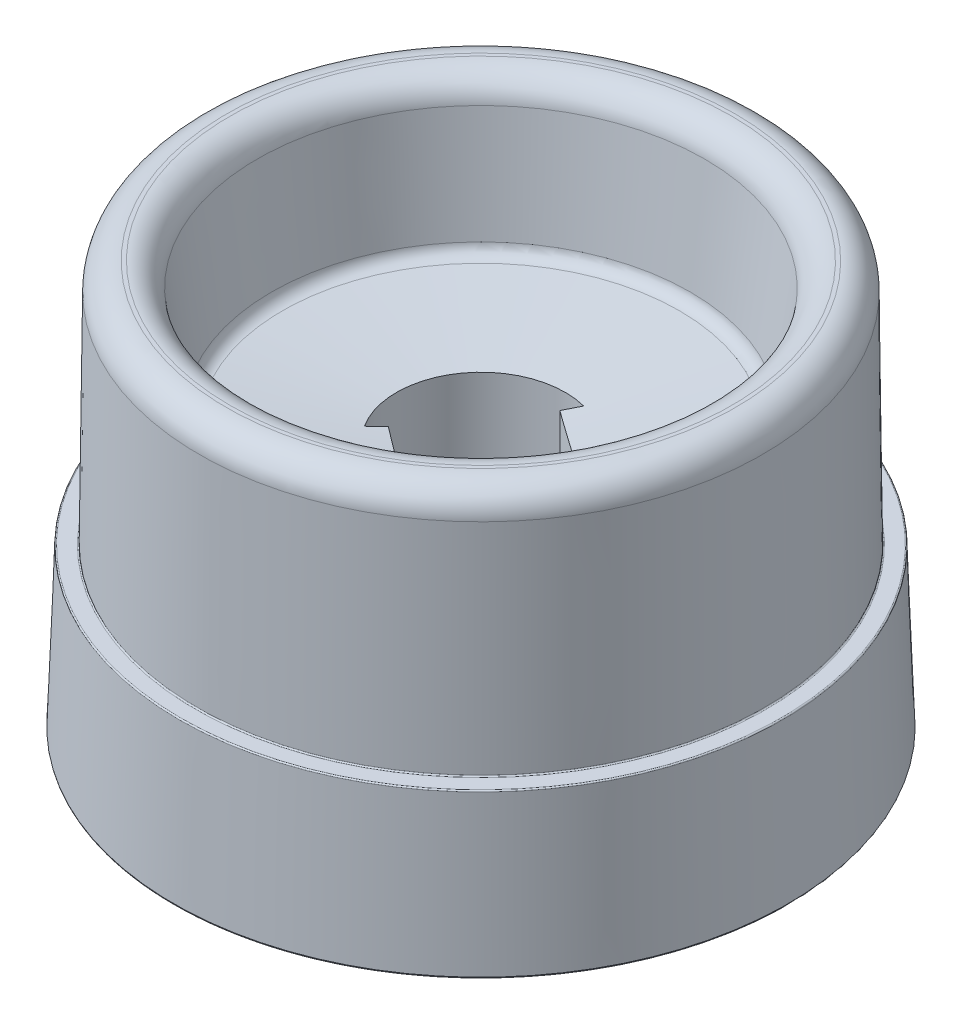
ISO-10303-21;
HEADER;
FILE_DESCRIPTION(('STEP AP214'),'2;1');
FILE_NAME('part.step','',(''),(''),'','','');
FILE_SCHEMA(('AUTOMOTIVE_DESIGN { 1 0 10303 214 1 1 1 1 }'));
ENDSEC;
DATA;
#1=APPLICATION_CONTEXT('core data for automotive mechanical design processes');
#2=APPLICATION_PROTOCOL_DEFINITION('international standard','automotive_design',2000,#1);
#3=PRODUCT_CONTEXT('',#1,'mechanical');
#4=PRODUCT('Part','Part','',(#3));
#5=PRODUCT_RELATED_PRODUCT_CATEGORY('part','',(#4));
#6=PRODUCT_DEFINITION_FORMATION('','',#4);
#7=PRODUCT_DEFINITION_CONTEXT('part definition',#1,'design');
#8=PRODUCT_DEFINITION('design','',#6,#7);
#9=PRODUCT_DEFINITION_SHAPE('','',#8);
#10=(LENGTH_UNIT() NAMED_UNIT(*) SI_UNIT(.MILLI.,.METRE.));
#11=(NAMED_UNIT(*) PLANE_ANGLE_UNIT() SI_UNIT($,.RADIAN.));
#12=(NAMED_UNIT(*) SI_UNIT($,.STERADIAN.) SOLID_ANGLE_UNIT());
#13=UNCERTAINTY_MEASURE_WITH_UNIT(LENGTH_MEASURE(1.E-05),#10,'distance_accuracy_value','');
#14=(GEOMETRIC_REPRESENTATION_CONTEXT(3) GLOBAL_UNCERTAINTY_ASSIGNED_CONTEXT((#13)) GLOBAL_UNIT_ASSIGNED_CONTEXT((#10,
#11,#12)) REPRESENTATION_CONTEXT('',''));
#15=CARTESIAN_POINT('',(0.,0.,0.));
#16=DIRECTION('',(0.,0.,1.));
#17=DIRECTION('',(1.,0.,0.));
#18=AXIS2_PLACEMENT_3D('',#15,#16,#17);
#19=CARTESIAN_POINT('',(0.,3.7,0.));
#20=DIRECTION('',(0.,-1.,0.));
#21=DIRECTION('',(0.,0.,-1.));
#22=AXIS2_PLACEMENT_3D('',#19,#20,#21);
#23=TOROIDAL_SURFACE('',#22,9.1594331148015,0.5);
#24=CARTESIAN_POINT('',(0.,3.70952208231858,0.));
#25=DIRECTION('',(0.,-1.,0.));
#26=DIRECTION('',(0.,0.,-1.));
#27=AXIS2_PLACEMENT_3D('',#24,#25,#26);
#28=CIRCLE('',#27,9.65934243652726);
#29=CARTESIAN_POINT('',(0.,3.70952208231858,-9.65934243652726));
#30=VERTEX_POINT('',#29);
#31=EDGE_CURVE('E139',#30,#30,#28,.T.);
#32=ORIENTED_EDGE('',*,*,#31,.T.);
#33=EDGE_LOOP('',(#32));
#34=FACE_BOUND('',#33,.T.);
#35=CARTESIAN_POINT('',(0.,4.2,0.));
#36=DIRECTION('',(0.,-1.,0.));
#37=DIRECTION('',(0.,0.,-1.));
#38=AXIS2_PLACEMENT_3D('',#35,#36,#37);
#39=CIRCLE('',#38,9.15943311480149);
#40=CARTESIAN_POINT('',(0.,4.2,-9.15943311480149));
#41=VERTEX_POINT('',#40);
#42=EDGE_CURVE('E194',#41,#41,#39,.T.);
#43=ORIENTED_EDGE('',*,*,#42,.F.);
#44=EDGE_LOOP('',(#43));
#45=FACE_BOUND('',#44,.T.);
#46=ADVANCED_FACE('F32',(#34,#45),#23,.F.);
#47=CARTESIAN_POINT('',(0.,4.2,0.));
#48=DIRECTION('',(0.,-1.,0.));
#49=DIRECTION('',(0.,0.,-1.));
#50=AXIS2_PLACEMENT_3D('',#47,#48,#49);
#51=PLANE('',#50);
#52=DIRECTION('',(-0.802543407330074,0.,-0.596593730566317));
#53=VECTOR('',#52,1.);
#54=CARTESIAN_POINT('',(-2.43770225381179,4.2,1.26780057194422));
#55=LINE('',#54,#53);
#56=CARTESIAN_POINT('',(-0.511598076219613,4.2,2.69962552530338));
#57=VERTEX_POINT('',#56);
#58=CARTESIAN_POINT('',(-2.43770225381179,4.2,1.26780057194422));
#59=VERTEX_POINT('',#58);
#60=EDGE_CURVE('E51',#57,#59,#55,.T.);
#61=ORIENTED_EDGE('',*,*,#60,.F.);
#62=DIRECTION('',(0.596593730566317,0.,-0.802543407330074));
#63=VECTOR('',#62,1.);
#64=CARTESIAN_POINT('',(-0.511598076219613,4.2,2.69962552530338));
#65=LINE('',#64,#63);
#66=CARTESIAN_POINT('',(-0.918959562800941,4.2,3.24761196683988));
#67=VERTEX_POINT('',#66);
#68=EDGE_CURVE('E134',#67,#57,#65,.T.);
#69=ORIENTED_EDGE('',*,*,#68,.F.);
#70=CARTESIAN_POINT('',(0.,4.2,0.));
#71=DIRECTION('',(0.,-1.,0.));
#72=DIRECTION('',(0.,0.,-1.));
#73=AXIS2_PLACEMENT_3D('',#70,#71,#72);
#74=CIRCLE('',#73,3.37512520734045);
#75=CARTESIAN_POINT('',(2.79957627615245,4.2,-1.88516387596127));
#76=VERTEX_POINT('',#75);
#77=EDGE_CURVE('E131',#76,#67,#74,.T.);
#78=ORIENTED_EDGE('',*,*,#77,.F.);
#79=DIRECTION('',(0.576688769844115,0.,-0.816963929886554));
#80=VECTOR('',#79,1.);
#81=CARTESIAN_POINT('',(2.40580613988994,4.2,-1.32733092547753));
#82=LINE('',#81,#80);
#83=CARTESIAN_POINT('',(2.40580613988994,4.2,-1.32733092547753));
#84=VERTEX_POINT('',#83);
#85=EDGE_CURVE('E128',#84,#76,#82,.T.);
#86=ORIENTED_EDGE('',*,*,#85,.F.);
#87=DIRECTION('',(0.816963929886553,0.,0.576688769844115));
#88=VECTOR('',#87,1.);
#89=CARTESIAN_POINT('',(0.445092708162211,4.2,-2.7113839731034));
#90=LINE('',#89,#88);
#91=CARTESIAN_POINT('',(0.445092708162211,4.2,-2.7113839731034));
#92=VERTEX_POINT('',#91);
#93=EDGE_CURVE('E122',#92,#84,#90,.T.);
#94=ORIENTED_EDGE('',*,*,#93,.F.);
#95=DIRECTION('',(-0.576688769844114,0.,0.816963929886554));
#96=VECTOR('',#95,1.);
#97=CARTESIAN_POINT('',(0.445092708162211,4.2,-2.7113839731034));
#98=LINE('',#97,#96);
#99=CARTESIAN_POINT('',(0.83886284442472,4.2,-3.26921692358714));
#100=VERTEX_POINT('',#99);
#101=EDGE_CURVE('E120',#100,#92,#98,.T.);
#102=ORIENTED_EDGE('',*,*,#101,.F.);
#103=CARTESIAN_POINT('',(0.,4.2,0.));
#104=DIRECTION('',(0.,-1.,0.));
#105=DIRECTION('',(0.,0.,-1.));
#106=AXIS2_PLACEMENT_3D('',#103,#104,#105);
#107=CIRCLE('',#106,3.37512520734045);
#108=CARTESIAN_POINT('',(-2.84506374039312,4.2,1.81578701348072));
#109=VERTEX_POINT('',#108);
#110=EDGE_CURVE('E103',#109,#100,#107,.T.);
#111=ORIENTED_EDGE('',*,*,#110,.F.);
#112=DIRECTION('',(-0.596593730566317,0.,0.802543407330073));
#113=VECTOR('',#112,1.);
#114=CARTESIAN_POINT('',(-2.43770225381179,4.2,1.26780057194422));
#115=LINE('',#114,#113);
#116=EDGE_CURVE('E112',#59,#109,#115,.T.);
#117=ORIENTED_EDGE('',*,*,#116,.F.);
#118=EDGE_LOOP('',(#61,#69,#78,#86,#94,#102,#111,#117));
#119=FACE_BOUND('',#118,.T.);
#120=ORIENTED_EDGE('',*,*,#42,.T.);
#121=EDGE_LOOP('',(#120));
#122=FACE_BOUND('',#121,.T.);
#123=ADVANCED_FACE('F116',(#119,#122),#51,.T.);
#124=CARTESIAN_POINT('',(0.,10.4837274017397,0.));
#125=DIRECTION('',(0.,1.,0.));
#126=DIRECTION('',(0.,0.,1.));
#127=AXIS2_PLACEMENT_3D('',#124,#125,#126);
#128=CONICAL_SURFACE('',#127,7.93580236429931,1.45118962765516);
#129=CARTESIAN_POINT('',(-2.43790225381179,9.86022942793745,1.26765189619033));
#130=CARTESIAN_POINT('',(-2.35767319360091,9.85498098863404,1.32729247624353));
#131=CARTESIAN_POINT('',(-2.27742145183765,9.8502634166295,1.38694991728123));
#132=CARTESIAN_POINT('',(-2.11687496087276,9.84203499021859,1.50629677017324));
#133=CARTESIAN_POINT('',(-2.03658020999301,9.83852418694828,1.56598618327503));
#134=CARTESIAN_POINT('',(-1.79577414095284,9.8300245839622,1.74499630255273));
#135=CARTESIAN_POINT('',(-1.63521215298427,9.82705969836108,1.86435467558826));
#136=CARTESIAN_POINT('',(-1.31408817704713,9.82705969836108,2.10307142165934));
#137=CARTESIAN_POINT('',(-1.15352618907856,9.8300245839622,2.22242979469487));
#138=CARTESIAN_POINT('',(-0.912720120038388,9.83852418694828,2.40143991397257));
#139=CARTESIAN_POINT('',(-0.832425369158636,9.84203499021859,2.46112932707436));
#140=CARTESIAN_POINT('',(-0.671878878193749,9.8502634166295,2.58047617996637));
#141=CARTESIAN_POINT('',(-0.591627136430488,9.85498098863404,2.64013362100407));
#142=CARTESIAN_POINT('',(-0.511398076219613,9.86022942793745,2.69977420105727));
#143=B_SPLINE_CURVE_WITH_KNOTS('',3,(#129,#130,#131,#132,#133,#134,#135,#136,#137,#138,#139,
#140,#141,#142),.UNSPECIFIED.,.F.,.F.,(4,2,2,2,2,2,4),(0.,0.300316948194724,0.600646620564161,
1.20082370492492,1.80100078928568,2.10133046165512,2.40164740984984),.UNSPECIFIED.);
#144=CARTESIAN_POINT('',(-2.43770225381179,9.86021634674101,1.26780057194422));
#145=VERTEX_POINT('',#144);
#146=CARTESIAN_POINT('',(-0.511598076219613,9.86021634674101,2.69962552530338));
#147=VERTEX_POINT('',#146);
#148=EDGE_CURVE('E11',#145,#147,#143,.T.);
#149=ORIENTED_EDGE('',*,*,#148,.F.);
#150=CARTESIAN_POINT('',(-2.84521241614701,9.93565167759545,1.81598701348072));
#151=CARTESIAN_POINT('',(-2.77728476004543,9.92283973891077,1.72461010187967));
#152=CARTESIAN_POINT('',(-2.70934936586354,9.91014524747306,1.63322278094135));
#153=CARTESIAN_POINT('',(-2.57346308650388,9.88499115634538,1.45042730043373));
#154=CARTESIAN_POINT('',(-2.50551220132274,9.8725315567067,1.35901914085988));
#155=CARTESIAN_POINT('',(-2.4375535780579,9.86018940436627,1.26760057194422));
#156=B_SPLINE_CURVE_WITH_KNOTS('',3,(#150,#151,#152,#153,#154,#155),.UNSPECIFIED.,.F.,.F.,(4,2,
4),(0.,0.343732589252377,0.687465253557977),.UNSPECIFIED.);
#157=CARTESIAN_POINT('',(-2.84506374039312,9.9356236845091,1.81578701348072));
#158=VERTEX_POINT('',#157);
#159=EDGE_CURVE('E197',#158,#145,#156,.T.);
#160=ORIENTED_EDGE('',*,*,#159,.F.);
#161=CARTESIAN_POINT('',(0.,9.9356236845091,0.));
#162=DIRECTION('',(0.,1.,0.));
#163=DIRECTION('',(0.,0.,1.));
#164=AXIS2_PLACEMENT_3D('',#161,#162,#163);
#165=CIRCLE('',#164,3.37512520734045);
#166=CARTESIAN_POINT('',(0.83886284442472,9.9356236845091,-3.26921692358714));
#167=VERTEX_POINT('',#166);
#168=EDGE_CURVE('E106',#167,#158,#165,.T.);
#169=ORIENTED_EDGE('',*,*,#168,.F.);
#170=CARTESIAN_POINT('',(0.444951529647776,9.86018987993127,-2.7111839731034));
#171=CARTESIAN_POINT('',(0.51064191179088,9.87253187676768,-2.80424400055267));
#172=CARTESIAN_POINT('',(0.576324814220776,9.88499131784736,-2.89729343189497));
#173=CARTESIAN_POINT('',(0.707675645314636,9.91014508574724,-3.08337108205159));
#174=CARTESIAN_POINT('',(0.773343573981867,9.92283941251615,-3.17639930087054));
#175=CARTESIAN_POINT('',(0.839004022939154,9.93565118347705,-3.26941692358714));
#176=B_SPLINE_CURVE_WITH_KNOTS('',3,(#170,#171,#172,#173,#174,#175),.UNSPECIFIED.,.F.,.F.,(4,2,
4),(0.,0.343728238803303,0.687456402557285),.UNSPECIFIED.);
#177=CARTESIAN_POINT('',(0.445092708162211,9.86021634674101,-2.7113839731034));
#178=VERTEX_POINT('',#177);
#179=EDGE_CURVE('E366',#178,#167,#176,.T.);
#180=ORIENTED_EDGE('',*,*,#179,.F.);
#181=CARTESIAN_POINT('',(2.40600613988994,9.86022919701751,-1.32718974696309));
#182=CARTESIAN_POINT('',(2.32433578076937,9.85498079246548,-1.38484024683339));
#183=CARTESIAN_POINT('',(2.2426423327344,9.8502632525071,-1.44250704499687));
#184=CARTESIAN_POINT('',(2.07921165687672,9.84203488290862,-1.55787154515081));
#185=CARTESIAN_POINT('',(1.99747442734576,9.83852410440362,-1.61556924834711));
#186=CARTESIAN_POINT('',(1.75234232637222,9.83002456191228,-1.78860617762668));
#187=CARTESIAN_POINT('',(1.58889587519915,9.82705969836108,-1.90398181345857));
#188=CARTESIAN_POINT('',(1.26200297285301,9.82705969836108,-2.13473308512236));
#189=CARTESIAN_POINT('',(1.09855652167993,9.83002456191228,-2.25010872095425));
#190=CARTESIAN_POINT('',(0.853424420706387,9.83852410440362,-2.42314565023382));
#191=CARTESIAN_POINT('',(0.771687191175431,9.84203488290862,-2.48084335343012));
#192=CARTESIAN_POINT('',(0.608256515317747,9.8502632525071,-2.59620785358406));
#193=CARTESIAN_POINT('',(0.526563067282777,9.85498079246548,-2.65387465174754));
#194=CARTESIAN_POINT('',(0.444892708162212,9.86022919701751,-2.71152515161784));
#195=B_SPLINE_CURVE_WITH_KNOTS('',3,(#181,#182,#183,#184,#185,#186,#187,#188,#189,#190,#191,
#192,#193,#194),.UNSPECIFIED.,.F.,.F.,(4,2,2,2,2,2,4),(0.,0.300315845935304,0.600644415830475,
1.20081930025914,1.80099418468781,2.10132275458298,2.40163860051829),.UNSPECIFIED.);
#196=CARTESIAN_POINT('',(2.40580613988994,9.86021634674101,-1.32733092547753));
#197=VERTEX_POINT('',#196);
#198=EDGE_CURVE('E371',#197,#178,#195,.T.);
#199=ORIENTED_EDGE('',*,*,#198,.F.);
#200=CARTESIAN_POINT('',(2.79971745466688,9.93565118347705,-1.88536387596127));
#201=CARTESIAN_POINT('',(2.73405700570959,9.92283941251615,-1.79234625324467));
#202=CARTESIAN_POINT('',(2.66838907704236,9.91014508574724,-1.69931803442571));
#203=CARTESIAN_POINT('',(2.5370382459485,9.88499131784736,-1.51324038426909));
#204=CARTESIAN_POINT('',(2.47135534351861,9.87253187676768,-1.4201909529268));
#205=CARTESIAN_POINT('',(2.4056649613755,9.86018987993127,-1.32713092547753));
#206=B_SPLINE_CURVE_WITH_KNOTS('',3,(#200,#201,#202,#203,#204,#205),.UNSPECIFIED.,.F.,.F.,(4,2,
4),(0.,0.343728163753981,0.687456402557284),.UNSPECIFIED.);
#207=CARTESIAN_POINT('',(2.79957627615245,9.9356236845091,-1.88516387596127));
#208=VERTEX_POINT('',#207);
#209=EDGE_CURVE('E376',#208,#197,#206,.T.);
#210=ORIENTED_EDGE('',*,*,#209,.F.);
#211=CARTESIAN_POINT('',(0.,9.9356236845091,0.));
#212=DIRECTION('',(0.,1.,0.));
#213=DIRECTION('',(0.,0.,1.));
#214=AXIS2_PLACEMENT_3D('',#211,#212,#213);
#215=CIRCLE('',#214,3.37512520734045);
#216=CARTESIAN_POINT('',(-0.918959562800941,9.9356236845091,3.24761196683988));
#217=VERTEX_POINT('',#216);
#218=EDGE_CURVE('E381',#217,#208,#215,.T.);
#219=ORIENTED_EDGE('',*,*,#218,.F.);
#220=CARTESIAN_POINT('',(-0.511449400465724,9.86018940436627,2.69942552530338));
#221=CARTESIAN_POINT('',(-0.579408023730565,9.8725315567067,2.79084409421904));
#222=CARTESIAN_POINT('',(-0.647358908911706,9.88499115634538,2.88225225379289));
#223=CARTESIAN_POINT('',(-0.783245188271362,9.91014524747306,3.06504773430052));
#224=CARTESIAN_POINT('',(-0.851180582453257,9.92283973891077,3.15643505523883));
#225=CARTESIAN_POINT('',(-0.919108238554831,9.93565167759545,3.24781196683988));
#226=B_SPLINE_CURVE_WITH_KNOTS('',3,(#220,#221,#222,#223,#224,#225),.UNSPECIFIED.,.F.,.F.,(4,2,
4),(0.,0.343732664305601,0.687465253557977),.UNSPECIFIED.);
#227=EDGE_CURVE('E44',#147,#217,#226,.T.);
#228=ORIENTED_EDGE('',*,*,#227,.F.);
#229=EDGE_LOOP('',(#149,#160,#169,#180,#199,#210,#219,#228));
#230=FACE_BOUND('',#229,.T.);
#231=CARTESIAN_POINT('',(0.,10.4837274017397,0.));
#232=DIRECTION('',(0.,-1.,0.));
#233=DIRECTION('',(0.,0.,-1.));
#234=AXIS2_PLACEMENT_3D('',#231,#232,#233);
#235=CIRCLE('',#234,7.93580236429931);
#236=CARTESIAN_POINT('',(0.,10.4837274017397,-7.93580236429931));
#237=VERTEX_POINT('',#236);
#238=EDGE_CURVE('E191',#237,#237,#235,.T.);
#239=ORIENTED_EDGE('',*,*,#238,.F.);
#240=EDGE_LOOP('',(#239));
#241=FACE_BOUND('',#240,.T.);
#242=ADVANCED_FACE('F204',(#230,#241),#128,.F.);
#243=CARTESIAN_POINT('',(0.,10.9801552227298,0.));
#244=DIRECTION('',(0.,-1.,0.));
#245=DIRECTION('',(0.,0.,-1.));
#246=AXIS2_PLACEMENT_3D('',#243,#244,#245);
#247=TOROIDAL_SURFACE('',#246,7.87614150152454,0.5);
#248=ORIENTED_EDGE('',*,*,#238,.T.);
#249=EDGE_LOOP('',(#248));
#250=FACE_BOUND('',#249,.T.);
#251=CARTESIAN_POINT('',(0.,10.9144321304999,0.));
#252=DIRECTION('',(0.,-1.,0.));
#253=DIRECTION('',(0.,0.,-1.));
#254=AXIS2_PLACEMENT_3D('',#251,#252,#253);
#255=CIRCLE('',#254,8.3718031554254);
#256=CARTESIAN_POINT('',(0.,10.9144321304999,-8.3718031554254));
#257=VERTEX_POINT('',#256);
#258=EDGE_CURVE('E188',#257,#257,#255,.T.);
#259=ORIENTED_EDGE('',*,*,#258,.F.);
#260=EDGE_LOOP('',(#259));
#261=FACE_BOUND('',#260,.T.);
#262=ADVANCED_FACE('F266',(#250,#261),#247,.F.);
#263=CARTESIAN_POINT('',(0.,15.2332763410613,0.));
#264=DIRECTION('',(0.,1.,0.));
#265=DIRECTION('',(0.,0.,1.));
#266=AXIS2_PLACEMENT_3D('',#263,#264,#265);
#267=CONICAL_SURFACE('',#266,8.9444675811352,0.131827681536379);
#268=ORIENTED_EDGE('',*,*,#258,.T.);
#269=EDGE_LOOP('',(#268));
#270=FACE_BOUND('',#269,.T.);
#271=CARTESIAN_POINT('',(0.,15.2332763410613,0.));
#272=DIRECTION('',(0.,-1.,0.));
#273=DIRECTION('',(0.,0.,-1.));
#274=AXIS2_PLACEMENT_3D('',#271,#272,#273);
#275=CIRCLE('',#274,8.9444675811352);
#276=CARTESIAN_POINT('',(0.,15.2332763410613,-8.9444675811352));
#277=VERTEX_POINT('',#276);
#278=EDGE_CURVE('E185',#277,#277,#275,.T.);
#279=ORIENTED_EDGE('',*,*,#278,.F.);
#280=EDGE_LOOP('',(#279));
#281=FACE_BOUND('',#280,.T.);
#282=ADVANCED_FACE('F263',(#270,#281),#267,.F.);
#283=CARTESIAN_POINT('',(0.,15.09,0.));
#284=DIRECTION('',(0.,-1.,0.));
#285=DIRECTION('',(0.,0.,-1.));
#286=AXIS2_PLACEMENT_3D('',#283,#284,#285);
#287=TOROIDAL_SURFACE('',#286,10.0250099866391,1.09);
#288=ORIENTED_EDGE('',*,*,#278,.T.);
#289=EDGE_LOOP('',(#288));
#290=FACE_BOUND('',#289,.T.);
#291=CARTESIAN_POINT('',(0.,16.18,0.));
#292=DIRECTION('',(0.,-1.,0.));
#293=DIRECTION('',(0.,0.,-1.));
#294=AXIS2_PLACEMENT_3D('',#291,#292,#293);
#295=CIRCLE('',#294,10.0250099866391);
#296=CARTESIAN_POINT('',(0.,16.18,-10.0250099866391));
#297=VERTEX_POINT('',#296);
#298=EDGE_CURVE('E182',#297,#297,#295,.T.);
#299=ORIENTED_EDGE('',*,*,#298,.F.);
#300=EDGE_LOOP('',(#299));
#301=FACE_BOUND('',#300,.T.);
#302=ADVANCED_FACE('F259',(#290,#301),#287,.T.);
#303=CARTESIAN_POINT('',(10.1721291115435,16.18,0.));
#304=DIRECTION('',(0.,1.,0.));
#305=DIRECTION('',(0.,0.,1.));
#306=AXIS2_PLACEMENT_3D('',#303,#304,#305);
#307=PLANE('',#306);
#308=ORIENTED_EDGE('',*,*,#298,.T.);
#309=EDGE_LOOP('',(#308));
#310=FACE_BOUND('',#309,.T.);
#311=CARTESIAN_POINT('',(0.,16.18,0.));
#312=DIRECTION('',(0.,-1.,0.));
#313=DIRECTION('',(0.,0.,-1.));
#314=AXIS2_PLACEMENT_3D('',#311,#312,#313);
#315=CIRCLE('',#314,10.1721291115435);
#316=CARTESIAN_POINT('',(0.,16.18,-10.1721291115435));
#317=VERTEX_POINT('',#316);
#318=EDGE_CURVE('E179',#317,#317,#315,.T.);
#319=ORIENTED_EDGE('',*,*,#318,.F.);
#320=EDGE_LOOP('',(#319));
#321=FACE_BOUND('',#320,.T.);
#322=ADVANCED_FACE('F255',(#310,#321),#307,.T.);
#323=CARTESIAN_POINT('',(0.,15.09,0.));
#324=DIRECTION('',(0.,-1.,0.));
#325=DIRECTION('',(0.,0.,-1.));
#326=AXIS2_PLACEMENT_3D('',#323,#324,#325);
#327=TOROIDAL_SURFACE('',#326,10.1721291115435,1.09);
#328=ORIENTED_EDGE('',*,*,#318,.T.);
#329=EDGE_LOOP('',(#328));
#330=FACE_BOUND('',#329,.T.);
#331=CARTESIAN_POINT('',(0.,15.1021965914228,0.));
#332=DIRECTION('',(0.,-1.,0.));
#333=DIRECTION('',(0.,0.,-1.));
#334=AXIS2_PLACEMENT_3D('',#331,#332,#333);
#335=CIRCLE('',#334,11.2620608723239);
#336=CARTESIAN_POINT('',(0.,15.1021965914228,-11.2620608723239));
#337=VERTEX_POINT('',#336);
#338=EDGE_CURVE('E176',#337,#337,#335,.T.);
#339=ORIENTED_EDGE('',*,*,#338,.F.);
#340=EDGE_LOOP('',(#339));
#341=FACE_BOUND('',#340,.T.);
#342=ADVANCED_FACE('F251',(#330,#341),#327,.T.);
#343=CARTESIAN_POINT('',(0.,6.39944052332923,0.));
#344=DIRECTION('',(0.,-1.,0.));
#345=DIRECTION('',(0.,0.,-1.));
#346=AXIS2_PLACEMENT_3D('',#343,#344,#345);
#347=CONICAL_SURFACE('',#346,11.359446748976,0.0111897669273583);
#348=ORIENTED_EDGE('',*,*,#338,.T.);
#349=EDGE_LOOP('',(#348));
#350=FACE_BOUND('',#349,.T.);
#351=CARTESIAN_POINT('',(0.,6.39944052332923,0.));
#352=DIRECTION('',(0.,-1.,0.));
#353=DIRECTION('',(0.,0.,-1.));
#354=AXIS2_PLACEMENT_3D('',#351,#352,#353);
#355=CIRCLE('',#354,11.359446748976);
#356=CARTESIAN_POINT('',(0.,6.39944052332923,-11.359446748976));
#357=VERTEX_POINT('',#356);
#358=EDGE_CURVE('E173',#357,#357,#355,.T.);
#359=ORIENTED_EDGE('',*,*,#358,.F.);
#360=EDGE_LOOP('',(#359));
#361=FACE_BOUND('',#360,.T.);
#362=ADVANCED_FACE('F247',(#350,#361),#347,.T.);
#363=CARTESIAN_POINT('',(0.,6.4,0.));
#364=DIRECTION('',(0.,-1.,0.));
#365=DIRECTION('',(0.,0.,-1.));
#366=AXIS2_PLACEMENT_3D('',#363,#364,#365);
#367=TOROIDAL_SURFACE('',#366,11.4094436187365,0.0499999999999995);
#368=ORIENTED_EDGE('',*,*,#358,.T.);
#369=EDGE_LOOP('',(#368));
#370=FACE_BOUND('',#369,.T.);
#371=CARTESIAN_POINT('',(0.,6.35,0.));
#372=DIRECTION('',(0.,-1.,0.));
#373=DIRECTION('',(0.,0.,-1.));
#374=AXIS2_PLACEMENT_3D('',#371,#372,#373);
#375=CIRCLE('',#374,11.4094436187365);
#376=CARTESIAN_POINT('',(0.,6.35,-11.4094436187365));
#377=VERTEX_POINT('',#376);
#378=EDGE_CURVE('E170',#377,#377,#375,.T.);
#379=ORIENTED_EDGE('',*,*,#378,.F.);
#380=EDGE_LOOP('',(#379));
#381=FACE_BOUND('',#380,.T.);
#382=ADVANCED_FACE('F243',(#370,#381),#367,.F.);
#383=CARTESIAN_POINT('',(11.4094436187365,6.35,0.));
#384=DIRECTION('',(0.,1.,0.));
#385=DIRECTION('',(0.,0.,1.));
#386=AXIS2_PLACEMENT_3D('',#383,#384,#385);
#387=PLANE('',#386);
#388=ORIENTED_EDGE('',*,*,#378,.T.);
#389=EDGE_LOOP('',(#388));
#390=FACE_BOUND('',#389,.T.);
#391=CARTESIAN_POINT('',(0.,6.35,0.));
#392=DIRECTION('',(0.,-1.,0.));
#393=DIRECTION('',(0.,0.,-1.));
#394=AXIS2_PLACEMENT_3D('',#391,#392,#393);
#395=CIRCLE('',#394,12.0017782363065);
#396=CARTESIAN_POINT('',(0.,6.35,-12.0017782363065));
#397=VERTEX_POINT('',#396);
#398=EDGE_CURVE('E167',#397,#397,#395,.T.);
#399=ORIENTED_EDGE('',*,*,#398,.F.);
#400=EDGE_LOOP('',(#399));
#401=FACE_BOUND('',#400,.T.);
#402=ADVANCED_FACE('F239',(#390,#401),#387,.T.);
#403=CARTESIAN_POINT('',(0.,6.3,0.));
#404=DIRECTION('',(0.,-1.,0.));
#405=DIRECTION('',(0.,0.,-1.));
#406=AXIS2_PLACEMENT_3D('',#403,#404,#405);
#407=TOROIDAL_SURFACE('',#406,12.0017782363065,0.0500000000000006);
#408=ORIENTED_EDGE('',*,*,#398,.T.);
#409=EDGE_LOOP('',(#408));
#410=FACE_BOUND('',#409,.T.);
#411=CARTESIAN_POINT('',(0.,6.30180983682822,0.));
#412=DIRECTION('',(0.,-1.,0.));
#413=DIRECTION('',(0.,0.,-1.));
#414=AXIS2_PLACEMENT_3D('',#411,#412,#413);
#415=CIRCLE('',#414,12.0517454704771);
#416=CARTESIAN_POINT('',(0.,6.30180983682822,-12.0517454704771));
#417=VERTEX_POINT('',#416);
#418=EDGE_CURVE('E164',#417,#417,#415,.T.);
#419=ORIENTED_EDGE('',*,*,#418,.F.);
#420=EDGE_LOOP('',(#419));
#421=FACE_BOUND('',#420,.T.);
#422=ADVANCED_FACE('F235',(#410,#421),#407,.T.);
#423=CARTESIAN_POINT('',(0.,0.0518098368282255,0.));
#424=DIRECTION('',(0.,-1.,0.));
#425=DIRECTION('',(0.,0.,-1.));
#426=AXIS2_PLACEMENT_3D('',#423,#424,#425);
#427=CONICAL_SURFACE('',#426,12.278123423233,0.0362046454116337);
#428=ORIENTED_EDGE('',*,*,#418,.T.);
#429=EDGE_LOOP('',(#428));
#430=FACE_BOUND('',#429,.T.);
#431=CARTESIAN_POINT('',(0.,0.0518098368282255,0.));
#432=DIRECTION('',(0.,-1.,0.));
#433=DIRECTION('',(0.,0.,-1.));
#434=AXIS2_PLACEMENT_3D('',#431,#432,#433);
#435=CIRCLE('',#434,12.278123423233);
#436=CARTESIAN_POINT('',(0.,0.0518098368282255,-12.278123423233));
#437=VERTEX_POINT('',#436);
#438=EDGE_CURVE('E161',#437,#437,#435,.T.);
#439=ORIENTED_EDGE('',*,*,#438,.F.);
#440=EDGE_LOOP('',(#439));
#441=FACE_BOUND('',#440,.T.);
#442=ADVANCED_FACE('F231',(#430,#441),#427,.T.);
#443=CARTESIAN_POINT('',(0.,0.05,0.));
#444=DIRECTION('',(0.,-1.,0.));
#445=DIRECTION('',(0.,0.,-1.));
#446=AXIS2_PLACEMENT_3D('',#443,#444,#445);
#447=TOROIDAL_SURFACE('',#446,12.2281561890624,0.0499999999999999);
#448=ORIENTED_EDGE('',*,*,#438,.T.);
#449=EDGE_LOOP('',(#448));
#450=FACE_BOUND('',#449,.T.);
#451=CARTESIAN_POINT('',(0.,0.,0.));
#452=DIRECTION('',(0.,-1.,0.));
#453=DIRECTION('',(0.,0.,-1.));
#454=AXIS2_PLACEMENT_3D('',#451,#452,#453);
#455=CIRCLE('',#454,12.2281561890624);
#456=CARTESIAN_POINT('',(0.,0.,-12.2281561890624));
#457=VERTEX_POINT('',#456);
#458=EDGE_CURVE('E158',#457,#457,#455,.T.);
#459=ORIENTED_EDGE('',*,*,#458,.F.);
#460=EDGE_LOOP('',(#459));
#461=FACE_BOUND('',#460,.T.);
#462=ADVANCED_FACE('F227',(#450,#461),#447,.T.);
#463=CARTESIAN_POINT('',(9.77905668851985,0.,0.));
#464=DIRECTION('',(0.,-1.,0.));
#465=DIRECTION('',(0.,0.,-1.));
#466=AXIS2_PLACEMENT_3D('',#463,#464,#465);
#467=PLANE('',#466);
#468=ORIENTED_EDGE('',*,*,#458,.T.);
#469=EDGE_LOOP('',(#468));
#470=FACE_BOUND('',#469,.T.);
#471=CARTESIAN_POINT('',(0.,0.,0.));
#472=DIRECTION('',(0.,-1.,0.));
#473=DIRECTION('',(0.,0.,-1.));
#474=AXIS2_PLACEMENT_3D('',#471,#472,#473);
#475=CIRCLE('',#474,9.77905668851985);
#476=CARTESIAN_POINT('',(0.,0.,-9.77905668851985));
#477=VERTEX_POINT('',#476);
#478=EDGE_CURVE('E155',#477,#477,#475,.T.);
#479=ORIENTED_EDGE('',*,*,#478,.F.);
#480=EDGE_LOOP('',(#479));
#481=FACE_BOUND('',#480,.T.);
#482=ADVANCED_FACE('F223',(#470,#481),#467,.T.);
#483=CARTESIAN_POINT('',(0.,0.05,0.));
#484=DIRECTION('',(0.,-1.,0.));
#485=DIRECTION('',(0.,0.,-1.));
#486=AXIS2_PLACEMENT_3D('',#483,#484,#485);
#487=TOROIDAL_SURFACE('',#486,9.77905668851985,0.0499999999999999);
#488=ORIENTED_EDGE('',*,*,#478,.T.);
#489=EDGE_LOOP('',(#488));
#490=FACE_BOUND('',#489,.T.);
#491=CARTESIAN_POINT('',(0.,0.0490477917681415,0.));
#492=DIRECTION('',(0.,-1.,0.));
#493=DIRECTION('',(0.,0.,-1.));
#494=AXIS2_PLACEMENT_3D('',#491,#492,#493);
#495=CIRCLE('',#494,9.72906575634727);
#496=CARTESIAN_POINT('',(0.,0.0490477917681415,-9.72906575634727));
#497=VERTEX_POINT('',#496);
#498=EDGE_CURVE('E152',#497,#497,#495,.T.);
#499=ORIENTED_EDGE('',*,*,#498,.F.);
#500=EDGE_LOOP('',(#499));
#501=FACE_BOUND('',#500,.T.);
#502=ADVANCED_FACE('F219',(#490,#501),#487,.T.);
#503=CARTESIAN_POINT('',(0.,3.70952208231858,0.));
#504=DIRECTION('',(0.,-1.,0.));
#505=DIRECTION('',(0.,0.,-1.));
#506=AXIS2_PLACEMENT_3D('',#503,#504,#505);
#507=CONICAL_SURFACE('',#506,9.65934243652726,0.0190453159820163);
#508=ORIENTED_EDGE('',*,*,#498,.T.);
#509=EDGE_LOOP('',(#508));
#510=FACE_BOUND('',#509,.T.);
#511=ORIENTED_EDGE('',*,*,#31,.F.);
#512=EDGE_LOOP('',(#511));
#513=FACE_BOUND('',#512,.T.);
#514=ADVANCED_FACE('F216',(#510,#513),#507,.F.);
#515=CARTESIAN_POINT('',(-2.43770225381179,14.2,1.26780057194422));
#516=DIRECTION('',(-0.596593730566317,0.,0.802543407330073));
#517=DIRECTION('',(0.802543407330073,0.,0.596593730566317));
#518=AXIS2_PLACEMENT_3D('',#515,#516,#517);
#519=PLANE('',#518);
#520=ORIENTED_EDGE('',*,*,#148,.T.);
#521=DIRECTION('',(0.,-1.,0.));
#522=VECTOR('',#521,1.);
#523=CARTESIAN_POINT('',(-0.511598076219613,14.2,2.69962552530338));
#524=LINE('',#523,#522);
#525=EDGE_CURVE('E137',#147,#57,#524,.T.);
#526=ORIENTED_EDGE('',*,*,#525,.T.);
#527=ORIENTED_EDGE('',*,*,#60,.T.);
#528=DIRECTION('',(0.,-1.,0.));
#529=VECTOR('',#528,1.);
#530=CARTESIAN_POINT('',(-2.43770225381179,14.2,1.26780057194422));
#531=LINE('',#530,#529);
#532=EDGE_CURVE('E109',#145,#59,#531,.T.);
#533=ORIENTED_EDGE('',*,*,#532,.F.);
#534=EDGE_LOOP('',(#520,#526,#527,#533));
#535=FACE_BOUND('',#534,.T.);
#536=ADVANCED_FACE('F211',(#535),#519,.F.);
#537=CARTESIAN_POINT('',(-0.511598076219613,14.2,2.69962552530338));
#538=DIRECTION('',(-0.802543407330073,0.,-0.596593730566317));
#539=DIRECTION('',(-0.596593730566317,0.,0.802543407330073));
#540=AXIS2_PLACEMENT_3D('',#537,#538,#539);
#541=PLANE('',#540);
#542=ORIENTED_EDGE('',*,*,#227,.T.);
#543=DIRECTION('',(0.,-1.,0.));
#544=VECTOR('',#543,1.);
#545=CARTESIAN_POINT('',(-0.918959562800941,14.2,3.24761196683988));
#546=LINE('',#545,#544);
#547=EDGE_CURVE('E140',#217,#67,#546,.T.);
#548=ORIENTED_EDGE('',*,*,#547,.T.);
#549=ORIENTED_EDGE('',*,*,#68,.T.);
#550=ORIENTED_EDGE('',*,*,#525,.F.);
#551=EDGE_LOOP('',(#542,#548,#549,#550));
#552=FACE_BOUND('',#551,.T.);
#553=ADVANCED_FACE('F215',(#552),#541,.F.);
#554=CARTESIAN_POINT('',(0.,14.2,0.));
#555=DIRECTION('',(0.,-1.,0.));
#556=DIRECTION('',(0.,0.,-1.));
#557=AXIS2_PLACEMENT_3D('',#554,#555,#556);
#558=CYLINDRICAL_SURFACE('',#557,3.37512520734045);
#559=ORIENTED_EDGE('',*,*,#218,.T.);
#560=DIRECTION('',(0.,-1.,0.));
#561=VECTOR('',#560,1.);
#562=CARTESIAN_POINT('',(2.79957627615245,14.2,-1.88516387596127));
#563=LINE('',#562,#561);
#564=EDGE_CURVE('E142',#208,#76,#563,.T.);
#565=ORIENTED_EDGE('',*,*,#564,.T.);
#566=ORIENTED_EDGE('',*,*,#77,.T.);
#567=ORIENTED_EDGE('',*,*,#547,.F.);
#568=EDGE_LOOP('',(#559,#565,#566,#567));
#569=FACE_BOUND('',#568,.T.);
#570=ADVANCED_FACE('F308',(#569),#558,.F.);
#571=CARTESIAN_POINT('',(2.40580613988994,14.2,-1.32733092547753));
#572=DIRECTION('',(-0.816963929886554,0.,-0.576688769844115));
#573=DIRECTION('',(-0.576688769844115,0.,0.816963929886554));
#574=AXIS2_PLACEMENT_3D('',#571,#572,#573);
#575=PLANE('',#574);
#576=ORIENTED_EDGE('',*,*,#209,.T.);
#577=DIRECTION('',(0.,-1.,0.));
#578=VECTOR('',#577,1.);
#579=CARTESIAN_POINT('',(2.40580613988994,14.2,-1.32733092547753));
#580=LINE('',#579,#578);
#581=EDGE_CURVE('E144',#197,#84,#580,.T.);
#582=ORIENTED_EDGE('',*,*,#581,.T.);
#583=ORIENTED_EDGE('',*,*,#85,.T.);
#584=ORIENTED_EDGE('',*,*,#564,.F.);
#585=EDGE_LOOP('',(#576,#582,#583,#584));
#586=FACE_BOUND('',#585,.T.);
#587=ADVANCED_FACE('F318',(#586),#575,.F.);
#588=CARTESIAN_POINT('',(0.445092708162211,14.2,-2.7113839731034));
#589=DIRECTION('',(0.576688769844115,0.,-0.816963929886553));
#590=DIRECTION('',(-0.816963929886554,0.,-0.576688769844115));
#591=AXIS2_PLACEMENT_3D('',#588,#589,#590);
#592=PLANE('',#591);
#593=ORIENTED_EDGE('',*,*,#198,.T.);
#594=DIRECTION('',(0.,-1.,0.));
#595=VECTOR('',#594,1.);
#596=CARTESIAN_POINT('',(0.445092708162211,14.2,-2.7113839731034));
#597=LINE('',#596,#595);
#598=EDGE_CURVE('E146',#178,#92,#597,.T.);
#599=ORIENTED_EDGE('',*,*,#598,.T.);
#600=ORIENTED_EDGE('',*,*,#93,.T.);
#601=ORIENTED_EDGE('',*,*,#581,.F.);
#602=EDGE_LOOP('',(#593,#599,#600,#601));
#603=FACE_BOUND('',#602,.T.);
#604=ADVANCED_FACE('F328',(#603),#592,.F.);
#605=CARTESIAN_POINT('',(0.445092708162211,14.2,-2.7113839731034));
#606=DIRECTION('',(0.816963929886554,0.,0.576688769844114));
#607=DIRECTION('',(0.576688769844114,0.,-0.816963929886554));
#608=AXIS2_PLACEMENT_3D('',#605,#606,#607);
#609=PLANE('',#608);
#610=ORIENTED_EDGE('',*,*,#179,.T.);
#611=DIRECTION('',(0.,-1.,0.));
#612=VECTOR('',#611,1.);
#613=CARTESIAN_POINT('',(0.83886284442472,14.2,-3.26921692358714));
#614=LINE('',#613,#612);
#615=EDGE_CURVE('E108',#167,#100,#614,.T.);
#616=ORIENTED_EDGE('',*,*,#615,.T.);
#617=ORIENTED_EDGE('',*,*,#101,.T.);
#618=ORIENTED_EDGE('',*,*,#598,.F.);
#619=EDGE_LOOP('',(#610,#616,#617,#618));
#620=FACE_BOUND('',#619,.T.);
#621=ADVANCED_FACE('F338',(#620),#609,.F.);
#622=CARTESIAN_POINT('',(0.,14.2,0.));
#623=DIRECTION('',(0.,-1.,0.));
#624=DIRECTION('',(0.,0.,-1.));
#625=AXIS2_PLACEMENT_3D('',#622,#623,#624);
#626=CYLINDRICAL_SURFACE('',#625,3.37512520734045);
#627=ORIENTED_EDGE('',*,*,#168,.T.);
#628=DIRECTION('',(0.,-1.,0.));
#629=VECTOR('',#628,1.);
#630=CARTESIAN_POINT('',(-2.84506374039312,14.2,1.81578701348072));
#631=LINE('',#630,#629);
#632=EDGE_CURVE('E59',#158,#109,#631,.T.);
#633=ORIENTED_EDGE('',*,*,#632,.T.);
#634=ORIENTED_EDGE('',*,*,#110,.T.);
#635=ORIENTED_EDGE('',*,*,#615,.F.);
#636=EDGE_LOOP('',(#627,#633,#634,#635));
#637=FACE_BOUND('',#636,.T.);
#638=ADVANCED_FACE('F100',(#637),#626,.F.);
#639=CARTESIAN_POINT('',(-2.43770225381179,14.2,1.26780057194422));
#640=DIRECTION('',(0.802543407330073,0.,0.596593730566317));
#641=DIRECTION('',(0.596593730566317,0.,-0.802543407330073));
#642=AXIS2_PLACEMENT_3D('',#639,#640,#641);
#643=PLANE('',#642);
#644=ORIENTED_EDGE('',*,*,#159,.T.);
#645=ORIENTED_EDGE('',*,*,#532,.T.);
#646=ORIENTED_EDGE('',*,*,#116,.T.);
#647=ORIENTED_EDGE('',*,*,#632,.F.);
#648=EDGE_LOOP('',(#644,#645,#646,#647));
#649=FACE_BOUND('',#648,.T.);
#650=ADVANCED_FACE('F113',(#649),#643,.F.);
#651=CLOSED_SHELL('',(#46,#123,#242,#262,#282,#302,#322,#342,#362,#382,#402,#422,#442,#462,#482,
#502,#514,#536,#553,#570,#587,#604,#621,#638,#650));
#652=MANIFOLD_SOLID_BREP('B2',#651);
#653=ADVANCED_BREP_SHAPE_REPRESENTATION('',(#18,#652),#14);
#654=SHAPE_DEFINITION_REPRESENTATION(#9,#653);
ENDSEC;
END-ISO-10303-21;
